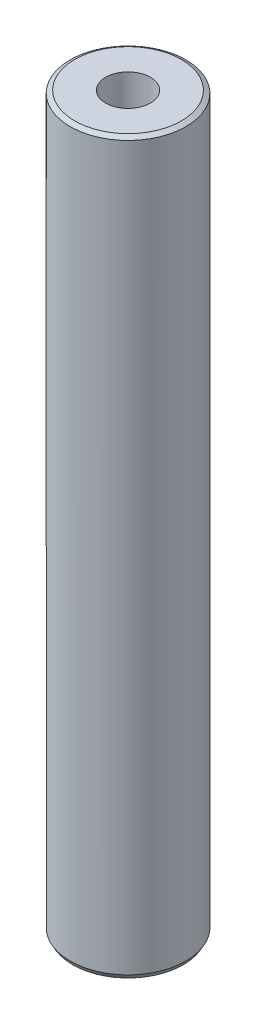
ISO-10303-21;
HEADER;
FILE_DESCRIPTION(('STEP AP214'),'2;1');
FILE_NAME('part.step','',(''),(''),'','','');
FILE_SCHEMA(('AUTOMOTIVE_DESIGN { 1 0 10303 214 1 1 1 1 }'));
ENDSEC;
DATA;
#1=APPLICATION_CONTEXT('core data for automotive mechanical design processes');
#2=APPLICATION_PROTOCOL_DEFINITION('international standard','automotive_design',2000,#1);
#3=PRODUCT_CONTEXT('',#1,'mechanical');
#4=PRODUCT('Part','Part','',(#3));
#5=PRODUCT_RELATED_PRODUCT_CATEGORY('part','',(#4));
#6=PRODUCT_DEFINITION_FORMATION('','',#4);
#7=PRODUCT_DEFINITION_CONTEXT('part definition',#1,'design');
#8=PRODUCT_DEFINITION('design','',#6,#7);
#9=PRODUCT_DEFINITION_SHAPE('','',#8);
#10=(LENGTH_UNIT() NAMED_UNIT(*) SI_UNIT(.MILLI.,.METRE.));
#11=(NAMED_UNIT(*) PLANE_ANGLE_UNIT() SI_UNIT($,.RADIAN.));
#12=(NAMED_UNIT(*) SI_UNIT($,.STERADIAN.) SOLID_ANGLE_UNIT());
#13=UNCERTAINTY_MEASURE_WITH_UNIT(LENGTH_MEASURE(1.E-05),#10,'distance_accuracy_value','');
#14=(GEOMETRIC_REPRESENTATION_CONTEXT(3) GLOBAL_UNCERTAINTY_ASSIGNED_CONTEXT((#13)) GLOBAL_UNIT_ASSIGNED_CONTEXT((#10,
#11,#12)) REPRESENTATION_CONTEXT('',''));
#15=CARTESIAN_POINT('',(0.,0.,0.));
#16=DIRECTION('',(0.,0.,1.));
#17=DIRECTION('',(1.,0.,0.));
#18=AXIS2_PLACEMENT_3D('',#15,#16,#17);
#19=CARTESIAN_POINT('',(0.,441.239828058858,0.));
#20=DIRECTION('',(0.,-1.,0.));
#21=DIRECTION('',(0.,0.,-1.));
#22=AXIS2_PLACEMENT_3D('',#19,#20,#21);
#23=CYLINDRICAL_SURFACE('',#22,35.);
#24=CARTESIAN_POINT('',(0.,439.642212562594,0.));
#25=DIRECTION('',(0.,1.,0.));
#26=DIRECTION('',(0.,0.,1.));
#27=AXIS2_PLACEMENT_3D('',#24,#25,#26);
#28=CIRCLE('',#27,35.);
#29=CARTESIAN_POINT('',(0.,439.642212562594,-35.0000000000001));
#30=VERTEX_POINT('',#29);
#31=EDGE_CURVE('E50',#30,#30,#28,.F.);
#32=ORIENTED_EDGE('',*,*,#31,.T.);
#33=EDGE_LOOP('',(#32));
#34=FACE_BOUND('',#33,.T.);
#35=CARTESIAN_POINT('',(0.,2.76715121048915,0.));
#36=DIRECTION('',(0.,1.,0.));
#37=DIRECTION('',(0.,0.,1.));
#38=AXIS2_PLACEMENT_3D('',#35,#36,#37);
#39=CIRCLE('',#38,35.);
#40=CARTESIAN_POINT('',(0.,2.76715121048915,35.));
#41=VERTEX_POINT('',#40);
#42=EDGE_CURVE('E51',#41,#41,#39,.T.);
#43=ORIENTED_EDGE('',*,*,#42,.T.);
#44=EDGE_LOOP('',(#43));
#45=FACE_BOUND('',#44,.T.);
#46=ADVANCED_FACE('F39',(#34,#45),#23,.T.);
#47=CARTESIAN_POINT('',(0.,441.239828058858,0.));
#48=DIRECTION('',(0.,1.,0.));
#49=DIRECTION('',(0.,0.,1.));
#50=AXIS2_PLACEMENT_3D('',#47,#48,#49);
#51=PLANE('',#50);
#52=CARTESIAN_POINT('',(0.,441.239828058858,0.));
#53=DIRECTION('',(0.,1.,0.));
#54=DIRECTION('',(0.,0.,1.));
#55=AXIS2_PLACEMENT_3D('',#52,#53,#54);
#56=CIRCLE('',#55,32.2328487895111);
#57=CARTESIAN_POINT('',(0.,441.239828058858,-32.2328487895112));
#58=VERTEX_POINT('',#57);
#59=EDGE_CURVE('E54',#58,#58,#56,.T.);
#60=ORIENTED_EDGE('',*,*,#59,.T.);
#61=EDGE_LOOP('',(#60));
#62=FACE_BOUND('',#61,.T.);
#63=CARTESIAN_POINT('',(0.,441.239828058858,0.));
#64=DIRECTION('',(0.,1.,0.));
#65=DIRECTION('',(0.,0.,1.));
#66=AXIS2_PLACEMENT_3D('',#63,#64,#65);
#67=CIRCLE('',#66,13.5408037791955);
#68=CARTESIAN_POINT('',(0.,441.239828058858,13.5408037791955));
#69=VERTEX_POINT('',#68);
#70=EDGE_CURVE('E58',#69,#69,#67,.T.);
#71=ORIENTED_EDGE('',*,*,#70,.F.);
#72=EDGE_LOOP('',(#71));
#73=FACE_BOUND('',#72,.T.);
#74=ADVANCED_FACE('F69',(#62,#73),#51,.T.);
#75=CARTESIAN_POINT('',(0.,0.,0.));
#76=DIRECTION('',(0.,1.,0.));
#77=DIRECTION('',(0.,0.,1.));
#78=AXIS2_PLACEMENT_3D('',#75,#76,#77);
#79=PLANE('',#78);
#80=CARTESIAN_POINT('',(0.,0.,0.));
#81=DIRECTION('',(0.,1.,0.));
#82=DIRECTION('',(0.,0.,1.));
#83=AXIS2_PLACEMENT_3D('',#80,#81,#82);
#84=CIRCLE('',#83,33.4023845037357);
#85=CARTESIAN_POINT('',(0.,0.,33.4023845037357));
#86=VERTEX_POINT('',#85);
#87=EDGE_CURVE('E10',#86,#86,#84,.F.);
#88=ORIENTED_EDGE('',*,*,#87,.T.);
#89=EDGE_LOOP('',(#88));
#90=FACE_BOUND('',#89,.T.);
#91=CARTESIAN_POINT('',(0.,0.,0.));
#92=DIRECTION('',(0.,1.,0.));
#93=DIRECTION('',(0.,0.,1.));
#94=AXIS2_PLACEMENT_3D('',#91,#92,#93);
#95=CIRCLE('',#94,13.5408037791955);
#96=CARTESIAN_POINT('',(0.,0.,13.5408037791955));
#97=VERTEX_POINT('',#96);
#98=EDGE_CURVE('E63',#97,#97,#95,.T.);
#99=ORIENTED_EDGE('',*,*,#98,.T.);
#100=EDGE_LOOP('',(#99));
#101=FACE_BOUND('',#100,.T.);
#102=ADVANCED_FACE('F75',(#90,#101),#79,.F.);
#103=CARTESIAN_POINT('',(0.,441.239828058858,0.));
#104=DIRECTION('',(0.,-1.,0.));
#105=DIRECTION('',(0.,0.,-1.));
#106=AXIS2_PLACEMENT_3D('',#103,#104,#105);
#107=CYLINDRICAL_SURFACE('',#106,13.5408037791955);
#108=ORIENTED_EDGE('',*,*,#70,.T.);
#109=EDGE_LOOP('',(#108));
#110=FACE_BOUND('',#109,.T.);
#111=ORIENTED_EDGE('',*,*,#98,.F.);
#112=EDGE_LOOP('',(#111));
#113=FACE_BOUND('',#112,.T.);
#114=ADVANCED_FACE('F70',(#110,#113),#107,.F.);
#115=CARTESIAN_POINT('',(0.,441.239828058858,0.));
#116=DIRECTION('',(0.,-1.,0.));
#117=DIRECTION('',(0.,0.,-1.));
#118=AXIS2_PLACEMENT_3D('',#115,#116,#117);
#119=CONICAL_SURFACE('',#118,32.2328487895111,1.04719755119659);
#120=CARTESIAN_POINT('',(0.,439.642212562594,-35.0000000000001));
#121=CARTESIAN_POINT('',(0.,439.65885439068,-34.9711755082241));
#122=CARTESIAN_POINT('',(0.,439.675496218766,-34.9423510164482));
#123=CARTESIAN_POINT('',(0.,439.708779874938,-34.8847020328964));
#124=CARTESIAN_POINT('',(0.,439.725421703024,-34.8558775411204));
#125=CARTESIAN_POINT('',(0.,439.758705359196,-34.7982285575686));
#126=CARTESIAN_POINT('',(0.,439.775347187282,-34.7694040657927));
#127=CARTESIAN_POINT('',(0.,439.808630843454,-34.7117550822408));
#128=CARTESIAN_POINT('',(0.,439.82527267154,-34.6829305904649));
#129=CARTESIAN_POINT('',(0.,439.858556327713,-34.625281606913));
#130=CARTESIAN_POINT('',(0.,439.875198155799,-34.5964571151371));
#131=CARTESIAN_POINT('',(0.,439.908481811971,-34.5388081315852));
#132=CARTESIAN_POINT('',(0.,439.925123640057,-34.5099836398093));
#133=CARTESIAN_POINT('',(0.,439.958407296229,-34.4523346562575));
#134=CARTESIAN_POINT('',(0.,439.975049124315,-34.4235101644815));
#135=CARTESIAN_POINT('',(0.,440.008332780487,-34.3658611809297));
#136=CARTESIAN_POINT('',(0.,440.024974608573,-34.3370366891538));
#137=CARTESIAN_POINT('',(0.,440.058258264746,-34.2793877056019));
#138=CARTESIAN_POINT('',(0.,440.074900092832,-34.250563213826));
#139=CARTESIAN_POINT('',(0.,440.108183749004,-34.1929142302741));
#140=CARTESIAN_POINT('',(0.,440.12482557709,-34.1640897384982));
#141=CARTESIAN_POINT('',(0.,440.158109233262,-34.1064407549463));
#142=CARTESIAN_POINT('',(0.,440.174751061348,-34.0776162631704));
#143=CARTESIAN_POINT('',(0.,440.20803471752,-34.0199672796186));
#144=CARTESIAN_POINT('',(0.,440.224676545607,-33.9911427878426));
#145=CARTESIAN_POINT('',(0.,440.257960201779,-33.9334938042908));
#146=CARTESIAN_POINT('',(0.,440.274602029865,-33.9046693125149));
#147=CARTESIAN_POINT('',(0.,440.307885686037,-33.847020328963));
#148=CARTESIAN_POINT('',(0.,440.324527514123,-33.8181958371871));
#149=CARTESIAN_POINT('',(0.,440.357811170295,-33.7605468536352));
#150=CARTESIAN_POINT('',(0.,440.374452998381,-33.7317223618593));
#151=CARTESIAN_POINT('',(0.,440.407736654553,-33.6740733783075));
#152=CARTESIAN_POINT('',(0.,440.42437848264,-33.6452488865315));
#153=CARTESIAN_POINT('',(0.,440.457662138812,-33.5875999029797));
#154=CARTESIAN_POINT('',(0.,440.474303966898,-33.5587754112037));
#155=CARTESIAN_POINT('',(0.,440.50758762307,-33.5011264276519));
#156=CARTESIAN_POINT('',(0.,440.524229451156,-33.472301935876));
#157=CARTESIAN_POINT('',(0.,440.557513107328,-33.4146529523241));
#158=CARTESIAN_POINT('',(0.,440.574154935414,-33.3858284605482));
#159=CARTESIAN_POINT('',(0.,440.607438591586,-33.3281794769963));
#160=CARTESIAN_POINT('',(0.,440.624080419673,-33.2993549852204));
#161=CARTESIAN_POINT('',(0.,440.657364075845,-33.2417060016686));
#162=CARTESIAN_POINT('',(0.,440.674005903931,-33.2128815098926));
#163=CARTESIAN_POINT('',(0.,440.707289560103,-33.1552325263408));
#164=CARTESIAN_POINT('',(0.,440.723931388189,-33.1264080345649));
#165=CARTESIAN_POINT('',(0.,440.757215044361,-33.068759051013));
#166=CARTESIAN_POINT('',(0.,440.773856872447,-33.0399345592371));
#167=CARTESIAN_POINT('',(0.,440.80714052862,-32.9822855756852));
#168=CARTESIAN_POINT('',(0.,440.823782356706,-32.9534610839093));
#169=CARTESIAN_POINT('',(0.,440.857066012878,-32.8958121003575));
#170=CARTESIAN_POINT('',(0.,440.873707840964,-32.8669876085815));
#171=CARTESIAN_POINT('',(0.,440.906991497136,-32.8093386250297));
#172=CARTESIAN_POINT('',(0.,440.923633325222,-32.7805141332538));
#173=CARTESIAN_POINT('',(0.,440.956916981394,-32.7228651497019));
#174=CARTESIAN_POINT('',(0.,440.97355880948,-32.694040657926));
#175=CARTESIAN_POINT('',(0.,441.006842465653,-32.6363916743741));
#176=CARTESIAN_POINT('',(0.,441.023484293739,-32.6075671825982));
#177=CARTESIAN_POINT('',(0.,441.056767949911,-32.5499181990463));
#178=CARTESIAN_POINT('',(0.,441.073409777997,-32.5210937072704));
#179=CARTESIAN_POINT('',(0.,441.106693434169,-32.4634447237186));
#180=CARTESIAN_POINT('',(0.,441.123335262255,-32.4346202319426));
#181=CARTESIAN_POINT('',(0.,441.156618918427,-32.3769712483908));
#182=CARTESIAN_POINT('',(0.,441.173260746513,-32.3481467566149));
#183=CARTESIAN_POINT('',(0.,441.206544402686,-32.290497773063));
#184=CARTESIAN_POINT('',(0.,441.223186230772,-32.2616732812871));
#185=CARTESIAN_POINT('',(0.,441.239828058858,-32.2328487895112));
#186=B_SPLINE_CURVE_WITH_KNOTS('',3,(#120,#121,#122,#123,#124,#125,#126,#127,#128,#129,#130,
#131,#132,#133,#134,#135,#136,#137,#138,#139,#140,#141,#142,#143,#144,#145,#146,#147,#148,#149,
#150,#151,#152,#153,#154,#155,#156,#157,#158,#159,#160,#161,#162,#163,#164,#165,#166,#167,#168,
#169,#170,#171,#172,#173,#174,#175,#176,#177,#178,#179,#180,#181,#182,#183,#184,#185),
.UNSPECIFIED.,.F.,.F.,(4,2,2,2,2,2,2,2,2,2,2,2,2,2,2,2,2,2,2,2,2,2,2,2,2,2,2,2,2,2,2,2,4),(0.,
0.0998509685165104,0.199701937033015,0.299552905549525,0.399403874066036,0.49925484258254,
0.59910581109905,0.698956779615561,0.798807748132065,0.898658716648576,0.998509685165086,
1.09836065368162,1.19821162219813,1.29806259071464,1.39791355923114,1.49776452774765,
1.59761549626416,1.69746646478067,1.79731743329718,1.89716840181369,1.99701937033019,
2.0968703388467,2.19672130736324,2.29657227587975,2.39642324439626,2.49627421291276,
2.59612518142927,2.69597614994578,2.79582711846229,2.8956780869788,2.99552905549531,
3.09538002401181,3.19523099252835),.UNSPECIFIED.);
#187=EDGE_CURVE('BSEAM81',#30,#58,#186,.T.);
#188=ORIENTED_EDGE('',*,*,#31,.F.);
#189=ORIENTED_EDGE('',*,*,#59,.F.);
#190=ORIENTED_EDGE('',*,*,#187,.T.);
#191=ORIENTED_EDGE('',*,*,#187,.F.);
#192=EDGE_LOOP('',(#188,#190,#189,#191));
#193=FACE_BOUND('',#192,.T.);
#194=ADVANCED_FACE('F81',(#193),#119,.T.);
#195=CARTESIAN_POINT('',(0.,2.76715121048915,0.));
#196=DIRECTION('',(0.,1.,0.));
#197=DIRECTION('',(0.,0.,1.));
#198=AXIS2_PLACEMENT_3D('',#195,#196,#197);
#199=CONICAL_SURFACE('',#198,35.,0.523598775598299);
#200=ORIENTED_EDGE('',*,*,#87,.F.);
#201=EDGE_LOOP('',(#200));
#202=FACE_BOUND('',#201,.T.);
#203=ORIENTED_EDGE('',*,*,#42,.F.);
#204=EDGE_LOOP('',(#203));
#205=FACE_BOUND('',#204,.T.);
#206=ADVANCED_FACE('F45',(#202,#205),#199,.T.);
#207=CLOSED_SHELL('',(#46,#74,#102,#114,#194,#206));
#208=MANIFOLD_SOLID_BREP('B2',#207);
#209=ADVANCED_BREP_SHAPE_REPRESENTATION('',(#18,#208),#14);
#210=SHAPE_DEFINITION_REPRESENTATION(#9,#209);
ENDSEC;
END-ISO-10303-21;
